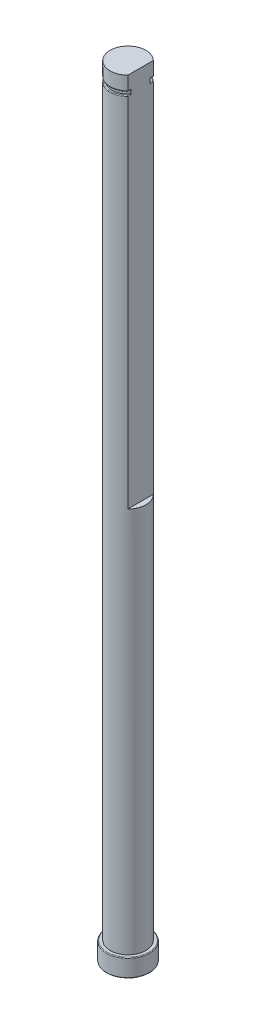
ISO-10303-21;
HEADER;
FILE_DESCRIPTION(('STEP AP214'),'2;1');
FILE_NAME('part.step','',(''),(''),'','','');
FILE_SCHEMA(('AUTOMOTIVE_DESIGN { 1 0 10303 214 1 1 1 1 }'));
ENDSEC;
DATA;
#1=APPLICATION_CONTEXT('core data for automotive mechanical design processes');
#2=APPLICATION_PROTOCOL_DEFINITION('international standard','automotive_design',2000,#1);
#3=PRODUCT_CONTEXT('',#1,'mechanical');
#4=PRODUCT('Part','Part','',(#3));
#5=PRODUCT_RELATED_PRODUCT_CATEGORY('part','',(#4));
#6=PRODUCT_DEFINITION_FORMATION('','',#4);
#7=PRODUCT_DEFINITION_CONTEXT('part definition',#1,'design');
#8=PRODUCT_DEFINITION('design','',#6,#7);
#9=PRODUCT_DEFINITION_SHAPE('','',#8);
#10=(LENGTH_UNIT() NAMED_UNIT(*) SI_UNIT(.MILLI.,.METRE.));
#11=(NAMED_UNIT(*) PLANE_ANGLE_UNIT() SI_UNIT($,.RADIAN.));
#12=(NAMED_UNIT(*) SI_UNIT($,.STERADIAN.) SOLID_ANGLE_UNIT());
#13=UNCERTAINTY_MEASURE_WITH_UNIT(LENGTH_MEASURE(1.E-05),#10,'distance_accuracy_value','');
#14=(GEOMETRIC_REPRESENTATION_CONTEXT(3) GLOBAL_UNCERTAINTY_ASSIGNED_CONTEXT((#13)) GLOBAL_UNIT_ASSIGNED_CONTEXT((#10,
#11,#12)) REPRESENTATION_CONTEXT('',''));
#15=CARTESIAN_POINT('',(0.,0.,0.));
#16=DIRECTION('',(0.,0.,1.));
#17=DIRECTION('',(1.,0.,0.));
#18=AXIS2_PLACEMENT_3D('',#15,#16,#17);
#19=CARTESIAN_POINT('',(0.,217.89,0.));
#20=DIRECTION('',(0.,-1.,0.));
#21=DIRECTION('',(0.,0.,-1.));
#22=AXIS2_PLACEMENT_3D('',#19,#20,#21);
#23=CYLINDRICAL_SURFACE('',#22,5.);
#24=DIRECTION('',(0.,1.,0.));
#25=VECTOR('',#24,1.);
#26=CARTESIAN_POINT('',(3.5,112.89,3.57071421427142));
#27=LINE('',#26,#25);
#28=CARTESIAN_POINT('',(3.5,112.89,3.57071421427142));
#29=VERTEX_POINT('',#28);
#30=CARTESIAN_POINT('',(3.5,212.69,3.57071421427142));
#31=VERTEX_POINT('',#30);
#32=EDGE_CURVE('E147',#29,#31,#27,.T.);
#33=ORIENTED_EDGE('',*,*,#32,.T.);
#34=CARTESIAN_POINT('',(0.,212.69,0.));
#35=DIRECTION('',(0.,1.,0.));
#36=DIRECTION('',(0.,0.,1.));
#37=AXIS2_PLACEMENT_3D('',#34,#35,#36);
#38=CIRCLE('',#37,5.);
#39=CARTESIAN_POINT('',(3.5,212.69,-3.57071421427142));
#40=VERTEX_POINT('',#39);
#41=EDGE_CURVE('E153',#31,#40,#38,.F.);
#42=ORIENTED_EDGE('',*,*,#41,.T.);
#43=DIRECTION('',(0.,1.,0.));
#44=VECTOR('',#43,1.);
#45=CARTESIAN_POINT('',(3.5,112.89,-3.57071421427142));
#46=LINE('',#45,#44);
#47=CARTESIAN_POINT('',(3.5,112.89,-3.57071421427142));
#48=VERTEX_POINT('',#47);
#49=EDGE_CURVE('E145',#48,#40,#46,.T.);
#50=ORIENTED_EDGE('',*,*,#49,.F.);
#51=CARTESIAN_POINT('',(0.,112.89,0.));
#52=DIRECTION('',(0.,1.,0.));
#53=DIRECTION('',(0.,0.,1.));
#54=AXIS2_PLACEMENT_3D('',#51,#52,#53);
#55=CIRCLE('',#54,5.);
#56=EDGE_CURVE('E130',#29,#48,#55,.T.);
#57=ORIENTED_EDGE('',*,*,#56,.F.);
#58=EDGE_LOOP('',(#33,#42,#50,#57));
#59=FACE_BOUND('',#58,.T.);
#60=CARTESIAN_POINT('',(0.,5.,0.));
#61=DIRECTION('',(0.,-1.,0.));
#62=DIRECTION('',(0.,0.,-1.));
#63=AXIS2_PLACEMENT_3D('',#60,#61,#62);
#64=CIRCLE('',#63,5.);
#65=CARTESIAN_POINT('',(0.,5.,-5.));
#66=VERTEX_POINT('',#65);
#67=EDGE_CURVE('E287',#66,#66,#64,.T.);
#68=ORIENTED_EDGE('',*,*,#67,.F.);
#69=EDGE_LOOP('',(#68));
#70=FACE_BOUND('',#69,.T.);
#71=ADVANCED_FACE('F51',(#59,#70),#23,.T.);
#72=CARTESIAN_POINT('',(3.5,214.09,-3.57071421427142));
#73=VERTEX_POINT('',#72);
#74=CARTESIAN_POINT('',(3.5,217.89,-3.57071421427142));
#75=VERTEX_POINT('',#74);
#76=EDGE_CURVE('E149',#73,#75,#46,.T.);
#77=ORIENTED_EDGE('',*,*,#76,.F.);
#78=CARTESIAN_POINT('',(0.,214.09,0.));
#79=DIRECTION('',(0.,1.,0.));
#80=DIRECTION('',(0.,0.,1.));
#81=AXIS2_PLACEMENT_3D('',#78,#79,#80);
#82=CIRCLE('',#81,5.);
#83=CARTESIAN_POINT('',(3.5,214.09,3.57071421427142));
#84=VERTEX_POINT('',#83);
#85=EDGE_CURVE('E195',#73,#84,#82,.T.);
#86=ORIENTED_EDGE('',*,*,#85,.T.);
#87=CARTESIAN_POINT('',(3.5,217.89,3.57071421427142));
#88=VERTEX_POINT('',#87);
#89=EDGE_CURVE('E155',#84,#88,#27,.T.);
#90=ORIENTED_EDGE('',*,*,#89,.T.);
#91=CARTESIAN_POINT('',(0.,217.89,0.));
#92=DIRECTION('',(0.,1.,0.));
#93=DIRECTION('',(0.,0.,1.));
#94=AXIS2_PLACEMENT_3D('',#91,#92,#93);
#95=CIRCLE('',#94,5.);
#96=EDGE_CURVE('E162',#75,#88,#95,.T.);
#97=ORIENTED_EDGE('',*,*,#96,.F.);
#98=EDGE_LOOP('',(#77,#86,#90,#97));
#99=FACE_BOUND('',#98,.T.);
#100=ADVANCED_FACE('F228',(#99),#23,.T.);
#101=CARTESIAN_POINT('',(0.,217.89,0.));
#102=DIRECTION('',(0.,1.,0.));
#103=DIRECTION('',(0.,0.,1.));
#104=AXIS2_PLACEMENT_3D('',#101,#102,#103);
#105=PLANE('',#104);
#106=DIRECTION('',(0.,0.,1.));
#107=VECTOR('',#106,1.);
#108=CARTESIAN_POINT('',(3.5,217.89,0.));
#109=LINE('',#108,#107);
#110=EDGE_CURVE('E138',#75,#88,#109,.T.);
#111=ORIENTED_EDGE('',*,*,#110,.F.);
#112=ORIENTED_EDGE('',*,*,#96,.T.);
#113=EDGE_LOOP('',(#111,#112));
#114=FACE_BOUND('',#113,.T.);
#115=ADVANCED_FACE('F330',(#114),#105,.T.);
#116=CARTESIAN_POINT('',(3.5,112.89,0.));
#117=DIRECTION('',(-1.,0.,0.));
#118=DIRECTION('',(0.,0.,1.));
#119=AXIS2_PLACEMENT_3D('',#116,#117,#118);
#120=PLANE('',#119);
#121=ORIENTED_EDGE('',*,*,#89,.F.);
#122=DIRECTION('',(0.,0.,-1.));
#123=VECTOR('',#122,1.);
#124=CARTESIAN_POINT('',(3.5,214.09,0.));
#125=LINE('',#124,#123);
#126=CARTESIAN_POINT('',(3.5,214.09,2.66645832519468));
#127=VERTEX_POINT('',#126);
#128=EDGE_CURVE('E175',#84,#127,#125,.T.);
#129=ORIENTED_EDGE('',*,*,#128,.T.);
#130=DIRECTION('',(0.,-1.,0.));
#131=VECTOR('',#130,1.);
#132=CARTESIAN_POINT('',(3.5,213.89,2.66645832519468));
#133=LINE('',#132,#131);
#134=CARTESIAN_POINT('',(3.5,212.69,2.66645832519468));
#135=VERTEX_POINT('',#134);
#136=EDGE_CURVE('E291',#127,#135,#133,.T.);
#137=ORIENTED_EDGE('',*,*,#136,.T.);
#138=DIRECTION('',(0.,0.,-1.));
#139=VECTOR('',#138,1.);
#140=CARTESIAN_POINT('',(3.5,212.69,3.57071421427142));
#141=LINE('',#140,#139);
#142=EDGE_CURVE('E172',#135,#31,#141,.F.);
#143=ORIENTED_EDGE('',*,*,#142,.T.);
#144=ORIENTED_EDGE('',*,*,#32,.F.);
#145=DIRECTION('',(0.,0.,1.));
#146=VECTOR('',#145,1.);
#147=CARTESIAN_POINT('',(3.5,112.89,0.));
#148=LINE('',#147,#146);
#149=EDGE_CURVE('E133',#48,#29,#148,.T.);
#150=ORIENTED_EDGE('',*,*,#149,.F.);
#151=ORIENTED_EDGE('',*,*,#49,.T.);
#152=DIRECTION('',(0.,0.,-1.));
#153=VECTOR('',#152,1.);
#154=CARTESIAN_POINT('',(3.5,212.69,-2.66645832519468));
#155=LINE('',#154,#153);
#156=CARTESIAN_POINT('',(3.5,212.69,-2.66645832519468));
#157=VERTEX_POINT('',#156);
#158=EDGE_CURVE('E166',#40,#157,#155,.F.);
#159=ORIENTED_EDGE('',*,*,#158,.T.);
#160=DIRECTION('',(0.,-1.,0.));
#161=VECTOR('',#160,1.);
#162=CARTESIAN_POINT('',(3.5,213.89,-2.66645832519468));
#163=LINE('',#162,#161);
#164=CARTESIAN_POINT('',(3.5,214.09,-2.66645832519468));
#165=VERTEX_POINT('',#164);
#166=EDGE_CURVE('E350',#165,#157,#163,.T.);
#167=ORIENTED_EDGE('',*,*,#166,.F.);
#168=DIRECTION('',(0.,0.,-1.));
#169=VECTOR('',#168,1.);
#170=CARTESIAN_POINT('',(3.5,214.09,0.));
#171=LINE('',#170,#169);
#172=EDGE_CURVE('E169',#165,#73,#171,.T.);
#173=ORIENTED_EDGE('',*,*,#172,.T.);
#174=ORIENTED_EDGE('',*,*,#76,.T.);
#175=ORIENTED_EDGE('',*,*,#110,.T.);
#176=EDGE_LOOP('',(#121,#129,#137,#143,#144,#150,#151,#159,#167,#173,#174,#175));
#177=FACE_BOUND('',#176,.T.);
#178=ADVANCED_FACE('F143',(#177),#120,.F.);
#179=CARTESIAN_POINT('',(0.,112.89,0.));
#180=DIRECTION('',(0.,1.,0.));
#181=DIRECTION('',(0.,0.,1.));
#182=AXIS2_PLACEMENT_3D('',#179,#180,#181);
#183=PLANE('',#182);
#184=ORIENTED_EDGE('',*,*,#56,.T.);
#185=ORIENTED_EDGE('',*,*,#149,.T.);
#186=EDGE_LOOP('',(#184,#185));
#187=FACE_BOUND('',#186,.T.);
#188=ADVANCED_FACE('F132',(#187),#183,.T.);
#189=CARTESIAN_POINT('',(0.,213.89,0.));
#190=DIRECTION('',(0.,-1.,0.));
#191=DIRECTION('',(0.,0.,-1.));
#192=AXIS2_PLACEMENT_3D('',#189,#190,#191);
#193=CYLINDRICAL_SURFACE('',#192,4.4);
#194=ORIENTED_EDGE('',*,*,#166,.T.);
#195=CARTESIAN_POINT('',(3.5,212.69,-2.66645832519468));
#196=CARTESIAN_POINT('',(3.50001572959241,212.698340122319,-2.66643640554394));
#197=CARTESIAN_POINT('',(3.4994794322201,212.706645047938,-2.66714170397318));
#198=CARTESIAN_POINT('',(3.49744914980149,212.72282973883,-2.66980408832565));
#199=CARTESIAN_POINT('',(3.49596704452966,212.730713481461,-2.67174564561712));
#200=CARTESIAN_POINT('',(3.49219437276219,212.745882112243,-2.67667468311572));
#201=CARTESIAN_POINT('',(3.48990775386464,212.753169714122,-2.67965705566883));
#202=CARTESIAN_POINT('',(3.48468414896616,212.767118941027,-2.68644653944985));
#203=CARTESIAN_POINT('',(3.48174501247574,212.773778389985,-2.69025637681479));
#204=CARTESIAN_POINT('',(3.47355573391022,212.790008437893,-2.70082882140917));
#205=CARTESIAN_POINT('',(3.46793819926475,212.799097609842,-2.70804344153627));
#206=CARTESIAN_POINT('',(3.45585807060967,212.815755486826,-2.72344302343464));
#207=CARTESIAN_POINT('',(3.44939357226424,212.82332066498,-2.73163016786257));
#208=CARTESIAN_POINT('',(3.43211600590083,212.840899805874,-2.75333661388644));
#209=CARTESIAN_POINT('',(3.42087785925408,212.849948582211,-2.76729720347349));
#210=CARTESIAN_POINT('',(3.39747563270113,212.865195792089,-2.79598021842651));
#211=CARTESIAN_POINT('',(3.38530944990888,212.871387513773,-2.81070434824146));
#212=CARTESIAN_POINT('',(3.36107279881261,212.880866149937,-2.83963440052699));
#213=CARTESIAN_POINT('',(3.34903654530551,212.884298764035,-2.85382189393174));
#214=CARTESIAN_POINT('',(3.32469473999505,212.888847187677,-2.88214451604545));
#215=CARTESIAN_POINT('',(3.31239200195113,212.889980765003,-2.89627919705818));
#216=CARTESIAN_POINT('',(3.3,212.89,-2.91032644217105));
#217=B_SPLINE_CURVE_WITH_KNOTS('',3,(#195,#196,#197,#198,#199,#200,#201,#202,#203,#204,#205,
#206,#207,#208,#209,#210,#211,#212,#213,#214,#215,#216),.UNSPECIFIED.,.F.,.F.,(4,2,2,2,2,2,2,2,
2,2,4),(0.,0.0249177085251996,0.0495284395601784,0.0740200568533302,0.0985936216132089,
0.137053189663787,0.175600764822116,0.235503299305924,0.295545850562678,0.352159352585193,
0.4083336318508),.UNSPECIFIED.);
#218=CARTESIAN_POINT('',(3.3,212.89,-2.91032644217105));
#219=VERTEX_POINT('',#218);
#220=EDGE_CURVE('E245',#157,#219,#217,.T.);
#221=ORIENTED_EDGE('',*,*,#220,.T.);
#222=CARTESIAN_POINT('',(0.,212.89,0.));
#223=DIRECTION('',(0.,1.,0.));
#224=DIRECTION('',(0.,0.,1.));
#225=AXIS2_PLACEMENT_3D('',#222,#223,#224);
#226=CIRCLE('',#225,4.4);
#227=CARTESIAN_POINT('',(3.3,212.89,2.91032644217105));
#228=VERTEX_POINT('',#227);
#229=EDGE_CURVE('E258',#219,#228,#226,.T.);
#230=ORIENTED_EDGE('',*,*,#229,.T.);
#231=CARTESIAN_POINT('',(3.3,212.89,2.91032644217105));
#232=CARTESIAN_POINT('',(3.30847190666142,212.889995855485,2.90072037980732));
#233=CARTESIAN_POINT('',(3.31689429232194,212.889462097017,2.89108536199942));
#234=CARTESIAN_POINT('',(3.33360904440519,212.887336862343,2.87179632769245));
#235=CARTESIAN_POINT('',(3.34190122018778,212.88574396082,2.86214230309417));
#236=CARTESIAN_POINT('',(3.36665779349885,212.879340592568,2.83306597750165));
#237=CARTESIAN_POINT('',(3.38283903785468,212.87290543495,2.81371459139366));
#238=CARTESIAN_POINT('',(3.40813355912034,212.858623074177,2.78296011017199));
#239=CARTESIAN_POINT('',(3.41766366547705,212.852157872184,2.7712433915368));
#240=CARTESIAN_POINT('',(3.43593526326525,212.837176225576,2.74855567544081));
#241=CARTESIAN_POINT('',(3.44467929474056,212.828666740022,2.7375823065774));
#242=CARTESIAN_POINT('',(3.45840670987927,212.812399023565,2.72020300256407));
#243=CARTESIAN_POINT('',(3.46369981678296,212.805267390093,2.71345688038356));
#244=CARTESIAN_POINT('',(3.47355436797751,212.789813095747,2.70083018049559));
#245=CARTESIAN_POINT('',(3.47811663408155,212.781491792847,2.69494863121841));
#246=CARTESIAN_POINT('',(3.48516068862098,212.765948160981,2.68582934950565));
#247=CARTESIAN_POINT('',(3.48787495829382,212.759002991741,2.68230186537504));
#248=CARTESIAN_POINT('',(3.49258107999117,212.744500873333,2.67617119159258));
#249=CARTESIAN_POINT('',(3.4945752152582,212.736945952328,2.67356508121489));
#250=CARTESIAN_POINT('',(3.49738424333157,212.722867949587,2.66988914128381));
#251=CARTESIAN_POINT('',(3.49835268101703,212.71642820271,2.66861958587352));
#252=CARTESIAN_POINT('',(3.49966642602793,212.703331125213,2.66689618824022));
#253=CARTESIAN_POINT('',(3.50000706482059,212.696672536283,2.6664484574925));
#254=CARTESIAN_POINT('',(3.5,212.69,2.66645832519468));
#255=B_SPLINE_CURVE_WITH_KNOTS('',3,(#231,#232,#233,#234,#235,#236,#237,#238,#239,#240,#241,
#242,#243,#244,#245,#246,#247,#248,#249,#250,#251,#252,#253,#254),.UNSPECIFIED.,.F.,.F.,(4,2,2,
2,2,2,2,2,2,2,2,4),(0.,0.0383917197041378,0.0768352090068305,0.154454266571866,
0.203624652584167,0.252629969364985,0.285999301981326,0.319330844108164,0.343992336356021,
0.368574936307703,0.388399211678372,0.408370321543627),.UNSPECIFIED.);
#256=EDGE_CURVE('E209',#228,#135,#255,.T.);
#257=ORIENTED_EDGE('',*,*,#256,.T.);
#258=ORIENTED_EDGE('',*,*,#136,.F.);
#259=CARTESIAN_POINT('',(3.5,214.09,2.66645832519468));
#260=CARTESIAN_POINT('',(3.50001572959241,214.081659877681,2.66643640554394));
#261=CARTESIAN_POINT('',(3.4994794322201,214.073354952062,2.66714170397318));
#262=CARTESIAN_POINT('',(3.49744914980149,214.05717026117,2.66980408832565));
#263=CARTESIAN_POINT('',(3.49596704452966,214.049286518539,2.67174564561711));
#264=CARTESIAN_POINT('',(3.49219437276219,214.034117887757,2.67667468311572));
#265=CARTESIAN_POINT('',(3.48990775386463,214.026830285878,2.67965705566884));
#266=CARTESIAN_POINT('',(3.48468414896616,214.012881058973,2.68644653944986));
#267=CARTESIAN_POINT('',(3.48174501247574,214.006221610015,2.6902563768148));
#268=CARTESIAN_POINT('',(3.47355573391022,213.989991562107,2.70082882140917));
#269=CARTESIAN_POINT('',(3.46793819926475,213.980902390158,2.70804344153627));
#270=CARTESIAN_POINT('',(3.45585807060967,213.964244513174,2.72344302343464));
#271=CARTESIAN_POINT('',(3.44939357226424,213.95667933502,2.73163016786257));
#272=CARTESIAN_POINT('',(3.43211600590083,213.939100194126,2.75333661388644));
#273=CARTESIAN_POINT('',(3.42087785925408,213.930051417789,2.76729720347349));
#274=CARTESIAN_POINT('',(3.39747563270113,213.914804207911,2.79598021842651));
#275=CARTESIAN_POINT('',(3.38530944990888,213.908612486227,2.81070434824146));
#276=CARTESIAN_POINT('',(3.36107279881261,213.899133850063,2.83963440052699));
#277=CARTESIAN_POINT('',(3.34903654530551,213.895701235965,2.85382189393174));
#278=CARTESIAN_POINT('',(3.32469473999505,213.891152812323,2.88214451604545));
#279=CARTESIAN_POINT('',(3.31239200195113,213.890019234997,2.89627919705818));
#280=CARTESIAN_POINT('',(3.3,213.89,2.91032644217105));
#281=B_SPLINE_CURVE_WITH_KNOTS('',3,(#259,#260,#261,#262,#263,#264,#265,#266,#267,#268,#269,
#270,#271,#272,#273,#274,#275,#276,#277,#278,#279,#280),.UNSPECIFIED.,.F.,.F.,(4,2,2,2,2,2,2,2,
2,2,4),(0.,0.0249177085251715,0.0495284395601784,0.0740200568533605,0.0985936216132095,
0.137053189663788,0.175600764822117,0.235503299305924,0.295545850562679,0.352159352585194,
0.408333631850801),.UNSPECIFIED.);
#282=CARTESIAN_POINT('',(3.3,213.89,2.91032644217105));
#283=VERTEX_POINT('',#282);
#284=EDGE_CURVE('E200',#127,#283,#281,.T.);
#285=ORIENTED_EDGE('',*,*,#284,.T.);
#286=CARTESIAN_POINT('',(0.,213.89,0.));
#287=DIRECTION('',(0.,1.,0.));
#288=DIRECTION('',(0.,0.,1.));
#289=AXIS2_PLACEMENT_3D('',#286,#287,#288);
#290=CIRCLE('',#289,4.4);
#291=CARTESIAN_POINT('',(3.3,213.89,-2.91032644217105));
#292=VERTEX_POINT('',#291);
#293=EDGE_CURVE('E356',#292,#283,#290,.T.);
#294=ORIENTED_EDGE('',*,*,#293,.F.);
#295=CARTESIAN_POINT('',(3.3,213.89,-2.91032644217105));
#296=CARTESIAN_POINT('',(3.30847190666142,213.890004144515,-2.90072037980732));
#297=CARTESIAN_POINT('',(3.31689429232194,213.890537902983,-2.89108536199942));
#298=CARTESIAN_POINT('',(3.33360904440519,213.892663137657,-2.87179632769245));
#299=CARTESIAN_POINT('',(3.34190122018778,213.89425603918,-2.86214230309417));
#300=CARTESIAN_POINT('',(3.36665779349885,213.900659407432,-2.83306597750165));
#301=CARTESIAN_POINT('',(3.38283903785468,213.90709456505,-2.81371459139366));
#302=CARTESIAN_POINT('',(3.40813355912034,213.921376925823,-2.78296011017199));
#303=CARTESIAN_POINT('',(3.41766366547704,213.927842127816,-2.7712433915368));
#304=CARTESIAN_POINT('',(3.43593526326524,213.942823774424,-2.74855567544082));
#305=CARTESIAN_POINT('',(3.44467929474056,213.951333259978,-2.73758230657741));
#306=CARTESIAN_POINT('',(3.45840670987928,213.967600976435,-2.72020300256406));
#307=CARTESIAN_POINT('',(3.46369981678298,213.974732609907,-2.71345688038354));
#308=CARTESIAN_POINT('',(3.47355436797753,213.990186904253,-2.70083018049556));
#309=CARTESIAN_POINT('',(3.47811663408155,213.998508207153,-2.6949486312184));
#310=CARTESIAN_POINT('',(3.48516068862098,214.014051839019,-2.68582934950566));
#311=CARTESIAN_POINT('',(3.48787495829382,214.020997008259,-2.68230186537504));
#312=CARTESIAN_POINT('',(3.49258107999117,214.035499126667,-2.67617119159258));
#313=CARTESIAN_POINT('',(3.4945752152582,214.043054047672,-2.67356508121489));
#314=CARTESIAN_POINT('',(3.49738424333156,214.057132050413,-2.66988914128381));
#315=CARTESIAN_POINT('',(3.49835268101703,214.06357179729,-2.66861958587352));
#316=CARTESIAN_POINT('',(3.49966642602793,214.076668874787,-2.66689618824022));
#317=CARTESIAN_POINT('',(3.50000706482059,214.083327463717,-2.6664484574925));
#318=CARTESIAN_POINT('',(3.5,214.09,-2.66645832519468));
#319=B_SPLINE_CURVE_WITH_KNOTS('',3,(#295,#296,#297,#298,#299,#300,#301,#302,#303,#304,#305,
#306,#307,#308,#309,#310,#311,#312,#313,#314,#315,#316,#317,#318),.UNSPECIFIED.,.F.,.F.,(4,2,2,
2,2,2,2,2,2,2,2,4),(0.,0.038391719704135,0.0768352090068305,0.154454266571866,0.203624652584159,
0.252629969364985,0.285999301981374,0.319330844108164,0.343992336355992,0.368574936307704,
0.388399211678373,0.408370321543628),.UNSPECIFIED.);
#320=EDGE_CURVE('E274',#292,#165,#319,.T.);
#321=ORIENTED_EDGE('',*,*,#320,.T.);
#322=EDGE_LOOP('',(#194,#221,#230,#257,#258,#285,#294,#321));
#323=FACE_BOUND('',#322,.T.);
#324=ADVANCED_FACE('F216',(#323),#193,.T.);
#325=CARTESIAN_POINT('',(0.,213.89,0.));
#326=DIRECTION('',(0.,1.,0.));
#327=DIRECTION('',(0.,0.,1.));
#328=AXIS2_PLACEMENT_3D('',#325,#326,#327);
#329=PLANE('',#328);
#330=ORIENTED_EDGE('',*,*,#293,.T.);
#331=DIRECTION('',(0.,0.,-1.));
#332=VECTOR('',#331,1.);
#333=CARTESIAN_POINT('',(3.3,213.89,0.));
#334=LINE('',#333,#332);
#335=CARTESIAN_POINT('',(3.3,213.89,3.48568501158667));
#336=VERTEX_POINT('',#335);
#337=EDGE_CURVE('E185',#283,#336,#334,.F.);
#338=ORIENTED_EDGE('',*,*,#337,.T.);
#339=CARTESIAN_POINT('',(0.,213.89,0.));
#340=DIRECTION('',(0.,1.,0.));
#341=DIRECTION('',(0.,0.,1.));
#342=AXIS2_PLACEMENT_3D('',#339,#340,#341);
#343=CIRCLE('',#342,4.8);
#344=CARTESIAN_POINT('',(3.3,213.89,-3.48568501158668));
#345=VERTEX_POINT('',#344);
#346=EDGE_CURVE('E179',#336,#345,#343,.F.);
#347=ORIENTED_EDGE('',*,*,#346,.T.);
#348=DIRECTION('',(0.,0.,-1.));
#349=VECTOR('',#348,1.);
#350=CARTESIAN_POINT('',(3.3,213.89,0.));
#351=LINE('',#350,#349);
#352=EDGE_CURVE('E182',#345,#292,#351,.F.);
#353=ORIENTED_EDGE('',*,*,#352,.T.);
#354=EDGE_LOOP('',(#330,#338,#347,#353));
#355=FACE_BOUND('',#354,.T.);
#356=ADVANCED_FACE('F362',(#355),#329,.F.);
#357=CARTESIAN_POINT('',(0.,212.89,0.));
#358=DIRECTION('',(0.,1.,0.));
#359=DIRECTION('',(0.,0.,1.));
#360=AXIS2_PLACEMENT_3D('',#357,#358,#359);
#361=PLANE('',#360);
#362=CARTESIAN_POINT('',(0.,212.89,0.));
#363=DIRECTION('',(0.,1.,0.));
#364=DIRECTION('',(0.,0.,1.));
#365=AXIS2_PLACEMENT_3D('',#362,#363,#364);
#366=CIRCLE('',#365,4.8);
#367=CARTESIAN_POINT('',(3.3,212.89,-3.48568501158668));
#368=VERTEX_POINT('',#367);
#369=CARTESIAN_POINT('',(3.3,212.89,3.48568501158667));
#370=VERTEX_POINT('',#369);
#371=EDGE_CURVE('E67',#368,#370,#366,.T.);
#372=ORIENTED_EDGE('',*,*,#371,.T.);
#373=DIRECTION('',(0.,0.,-1.));
#374=VECTOR('',#373,1.);
#375=CARTESIAN_POINT('',(3.3,212.89,2.66645832519468));
#376=LINE('',#375,#374);
#377=EDGE_CURVE('E192',#370,#228,#376,.T.);
#378=ORIENTED_EDGE('',*,*,#377,.T.);
#379=ORIENTED_EDGE('',*,*,#229,.F.);
#380=DIRECTION('',(0.,0.,-1.));
#381=VECTOR('',#380,1.);
#382=CARTESIAN_POINT('',(3.3,212.89,-3.57071421427142));
#383=LINE('',#382,#381);
#384=EDGE_CURVE('E72',#219,#368,#383,.T.);
#385=ORIENTED_EDGE('',*,*,#384,.T.);
#386=EDGE_LOOP('',(#372,#378,#379,#385));
#387=FACE_BOUND('',#386,.T.);
#388=ADVANCED_FACE('F269',(#387),#361,.T.);
#389=CARTESIAN_POINT('',(3.3,214.09,0.));
#390=DIRECTION('',(0.,0.,-1.));
#391=DIRECTION('',(-1.,0.,0.));
#392=AXIS2_PLACEMENT_3D('',#389,#390,#391);
#393=CYLINDRICAL_SURFACE('',#392,0.2);
#394=ORIENTED_EDGE('',*,*,#320,.F.);
#395=ORIENTED_EDGE('',*,*,#352,.F.);
#396=CARTESIAN_POINT('',(3.5,214.09,-3.57071421427142));
#397=CARTESIAN_POINT('',(3.50001202853429,214.079382809665,-3.57071906284533));
#398=CARTESIAN_POINT('',(3.49915539882841,214.068773469745,-3.5703594095157));
#399=CARTESIAN_POINT('',(3.49579916765285,214.047894872728,-3.56894919847386));
#400=CARTESIAN_POINT('',(3.49330422944727,214.037624737012,-3.56790060175822));
#401=CARTESIAN_POINT('',(3.48676567383597,214.017688181021,-3.56515059809789));
#402=CARTESIAN_POINT('',(3.48272248587823,214.0080215942,-3.56344937217692));
#403=CARTESIAN_POINT('',(3.47324393907842,213.989528674918,-3.55945723610596));
#404=CARTESIAN_POINT('',(3.46780805280431,213.980702662535,-3.55716610254903));
#405=CARTESIAN_POINT('',(3.45553926758007,213.963826283551,-3.55198883506433));
#406=CARTESIAN_POINT('',(3.44866772485283,213.955809147366,-3.5490862184826));
#407=CARTESIAN_POINT('',(3.43386176614914,213.941035265076,-3.54282304109023));
#408=CARTESIAN_POINT('',(3.42592699164064,213.934278945977,-3.53946232579764));
#409=CARTESIAN_POINT('',(3.40859947071133,213.921687223387,-3.53211167438113));
#410=CARTESIAN_POINT('',(3.39914226821589,213.915957080457,-3.52809357129958));
#411=CARTESIAN_POINT('',(3.37952729270225,213.906164185875,-3.51974420815357));
#412=CARTESIAN_POINT('',(3.36936931032981,213.902101935038,-3.51541285448834));
#413=CARTESIAN_POINT('',(3.34988928019782,213.896087736977,-3.50709039062174));
#414=CARTESIAN_POINT('',(3.34061718964717,213.893938286675,-3.50312256568254));
#415=CARTESIAN_POINT('',(3.32191154981102,213.89097924408,-3.49510381226007));
#416=CARTESIAN_POINT('',(3.31247833632011,213.890167143974,-3.49105305377615));
#417=CARTESIAN_POINT('',(3.30203250822153,213.890007729618,-3.48655958215352));
#418=CARTESIAN_POINT('',(3.30101617405265,213.889999981842,-3.48612230398671));
#419=CARTESIAN_POINT('',(3.3,213.89,-3.48568501158668));
#420=B_SPLINE_CURVE_WITH_KNOTS('',3,(#396,#397,#398,#399,#400,#401,#402,#403,#404,#405,#406,
#407,#408,#409,#410,#411,#412,#413,#414,#415,#416,#417,#418,#419),.UNSPECIFIED.,.F.,.F.,(4,2,2,
2,2,2,2,2,2,2,2,4),(0.,0.0317988173652862,0.0635075129832495,0.0952074197200754,
0.126919349394092,0.159631156340519,0.192354021915411,0.227500341683065,0.262657207078277,
0.293508931495438,0.324302736257748,0.327621926842854),.UNSPECIFIED.);
#421=EDGE_CURVE('E243',#73,#345,#420,.T.);
#422=ORIENTED_EDGE('',*,*,#421,.F.);
#423=ORIENTED_EDGE('',*,*,#172,.F.);
#424=EDGE_LOOP('',(#394,#395,#422,#423));
#425=FACE_BOUND('',#424,.T.);
#426=ADVANCED_FACE('F266',(#425),#393,.T.);
#427=CARTESIAN_POINT('',(0.,214.09,0.));
#428=DIRECTION('',(0.,1.,0.));
#429=DIRECTION('',(0.,0.,1.));
#430=AXIS2_PLACEMENT_3D('',#427,#428,#429);
#431=TOROIDAL_SURFACE('',#430,4.8,0.2);
#432=ORIENTED_EDGE('',*,*,#421,.T.);
#433=ORIENTED_EDGE('',*,*,#346,.F.);
#434=CARTESIAN_POINT('',(3.5,214.09,3.57071421427142));
#435=CARTESIAN_POINT('',(3.50001202853429,214.079382809665,3.57071906284533));
#436=CARTESIAN_POINT('',(3.49915539882841,214.068773469745,3.5703594095157));
#437=CARTESIAN_POINT('',(3.49579916765285,214.047894872728,3.56894919847386));
#438=CARTESIAN_POINT('',(3.49330422944727,214.037624737012,3.56790060175822));
#439=CARTESIAN_POINT('',(3.48676567383597,214.017688181021,3.56515059809789));
#440=CARTESIAN_POINT('',(3.48272248587823,214.0080215942,3.56344937217692));
#441=CARTESIAN_POINT('',(3.47324393907842,213.989528674918,3.55945723610596));
#442=CARTESIAN_POINT('',(3.46780805280431,213.980702662535,3.55716610254903));
#443=CARTESIAN_POINT('',(3.45553926758007,213.963826283551,3.55198883506433));
#444=CARTESIAN_POINT('',(3.44866772485283,213.955809147366,3.5490862184826));
#445=CARTESIAN_POINT('',(3.43386176614914,213.941035265076,3.54282304109023));
#446=CARTESIAN_POINT('',(3.42592699164064,213.934278945977,3.53946232579764));
#447=CARTESIAN_POINT('',(3.40859947071133,213.921687223387,3.53211167438113));
#448=CARTESIAN_POINT('',(3.39914226821589,213.915957080457,3.52809357129958));
#449=CARTESIAN_POINT('',(3.37952729270225,213.906164185875,3.51974420815357));
#450=CARTESIAN_POINT('',(3.36936931032981,213.902101935038,3.51541285448834));
#451=CARTESIAN_POINT('',(3.34988928019782,213.896087736977,3.50709039062174));
#452=CARTESIAN_POINT('',(3.34061718964717,213.893938286675,3.50312256568254));
#453=CARTESIAN_POINT('',(3.32191154981102,213.89097924408,3.49510381226007));
#454=CARTESIAN_POINT('',(3.31247833632011,213.890167143974,3.49105305377615));
#455=CARTESIAN_POINT('',(3.30203250822153,213.890007729618,3.48655958215352));
#456=CARTESIAN_POINT('',(3.30101617405265,213.889999981842,3.48612230398671));
#457=CARTESIAN_POINT('',(3.3,213.89,3.48568501158668));
#458=B_SPLINE_CURVE_WITH_KNOTS('',3,(#434,#435,#436,#437,#438,#439,#440,#441,#442,#443,#444,
#445,#446,#447,#448,#449,#450,#451,#452,#453,#454,#455,#456,#457),.UNSPECIFIED.,.F.,.F.,(4,2,2,
2,2,2,2,2,2,2,2,4),(0.,0.0317988173652862,0.0635075129832495,0.0952074197200754,
0.126919349394092,0.159631156340519,0.192354021915411,0.227500341683065,0.262657207078277,
0.293508931495438,0.324302736257748,0.327621926842854),.UNSPECIFIED.);
#459=EDGE_CURVE('E234',#84,#336,#458,.T.);
#460=ORIENTED_EDGE('',*,*,#459,.F.);
#461=ORIENTED_EDGE('',*,*,#85,.F.);
#462=EDGE_LOOP('',(#432,#433,#460,#461));
#463=FACE_BOUND('',#462,.T.);
#464=ADVANCED_FACE('F226',(#463),#431,.T.);
#465=CARTESIAN_POINT('',(3.3,214.09,0.));
#466=DIRECTION('',(0.,0.,-1.));
#467=DIRECTION('',(-1.,0.,0.));
#468=AXIS2_PLACEMENT_3D('',#465,#466,#467);
#469=CYLINDRICAL_SURFACE('',#468,0.2);
#470=ORIENTED_EDGE('',*,*,#459,.T.);
#471=ORIENTED_EDGE('',*,*,#337,.F.);
#472=ORIENTED_EDGE('',*,*,#284,.F.);
#473=ORIENTED_EDGE('',*,*,#128,.F.);
#474=EDGE_LOOP('',(#470,#471,#472,#473));
#475=FACE_BOUND('',#474,.T.);
#476=ADVANCED_FACE('F220',(#475),#469,.T.);
#477=CARTESIAN_POINT('',(3.3,212.69,0.));
#478=DIRECTION('',(0.,0.,1.));
#479=DIRECTION('',(1.,0.,0.));
#480=AXIS2_PLACEMENT_3D('',#477,#478,#479);
#481=CYLINDRICAL_SURFACE('',#480,0.2);
#482=ORIENTED_EDGE('',*,*,#220,.F.);
#483=ORIENTED_EDGE('',*,*,#158,.F.);
#484=CARTESIAN_POINT('',(3.5,212.69,-3.57071421427142));
#485=CARTESIAN_POINT('',(3.50001202853429,212.700617190335,-3.57071906284533));
#486=CARTESIAN_POINT('',(3.4991553988284,212.711226530255,-3.57035940951569));
#487=CARTESIAN_POINT('',(3.49579916765285,212.732105127272,-3.56894919847386));
#488=CARTESIAN_POINT('',(3.49330422944727,212.742375262988,-3.56790060175822));
#489=CARTESIAN_POINT('',(3.48676567383597,212.762311818979,-3.56515059809789));
#490=CARTESIAN_POINT('',(3.48272248587823,212.7719784058,-3.56344937217692));
#491=CARTESIAN_POINT('',(3.47324393907842,212.790471325082,-3.55945723610596));
#492=CARTESIAN_POINT('',(3.46780805280431,212.799297337465,-3.55716610254903));
#493=CARTESIAN_POINT('',(3.45553926758007,212.816173716449,-3.55198883506433));
#494=CARTESIAN_POINT('',(3.44866772485282,212.824190852634,-3.54908621848259));
#495=CARTESIAN_POINT('',(3.43386176614913,212.838964734924,-3.54282304109022));
#496=CARTESIAN_POINT('',(3.42592699164064,212.845721054023,-3.53946232579764));
#497=CARTESIAN_POINT('',(3.40859947071133,212.858312776613,-3.53211167438113));
#498=CARTESIAN_POINT('',(3.39914226821589,212.864042919543,-3.52809357129958));
#499=CARTESIAN_POINT('',(3.37952729270225,212.873835814125,-3.51974420815357));
#500=CARTESIAN_POINT('',(3.36936931032981,212.877898064962,-3.51541285448834));
#501=CARTESIAN_POINT('',(3.34988928019782,212.883912263023,-3.50709039062174));
#502=CARTESIAN_POINT('',(3.34061718964717,212.886061713325,-3.50312256568254));
#503=CARTESIAN_POINT('',(3.32191154981102,212.88902075592,-3.49510381226007));
#504=CARTESIAN_POINT('',(3.31247833632011,212.889832856026,-3.49105305377615));
#505=CARTESIAN_POINT('',(3.30203250822153,212.889992270382,-3.48655958215352));
#506=CARTESIAN_POINT('',(3.30101617405265,212.890000018158,-3.48612230398671));
#507=CARTESIAN_POINT('',(3.3,212.89,-3.48568501158668));
#508=B_SPLINE_CURVE_WITH_KNOTS('',3,(#484,#485,#486,#487,#488,#489,#490,#491,#492,#493,#494,
#495,#496,#497,#498,#499,#500,#501,#502,#503,#504,#505,#506,#507),.UNSPECIFIED.,.F.,.F.,(4,2,2,
2,2,2,2,2,2,2,2,4),(0.,0.0317988173653143,0.0635075129832495,0.0952074197200754,
0.126919349394092,0.159631156340529,0.192354021915409,0.227500341683063,0.262657207078275,
0.293508931495432,0.324302736257747,0.327621926842852),.UNSPECIFIED.);
#509=EDGE_CURVE('E244',#368,#40,#508,.F.);
#510=ORIENTED_EDGE('',*,*,#509,.F.);
#511=ORIENTED_EDGE('',*,*,#384,.F.);
#512=EDGE_LOOP('',(#482,#483,#510,#511));
#513=FACE_BOUND('',#512,.T.);
#514=ADVANCED_FACE('F225',(#513),#481,.T.);
#515=CARTESIAN_POINT('',(0.,212.69,0.));
#516=DIRECTION('',(0.,1.,0.));
#517=DIRECTION('',(0.,0.,1.));
#518=AXIS2_PLACEMENT_3D('',#515,#516,#517);
#519=TOROIDAL_SURFACE('',#518,4.8,0.2);
#520=ORIENTED_EDGE('',*,*,#509,.T.);
#521=ORIENTED_EDGE('',*,*,#41,.F.);
#522=CARTESIAN_POINT('',(3.5,212.69,3.57071421427142));
#523=CARTESIAN_POINT('',(3.50001202853429,212.700617190335,3.57071906284533));
#524=CARTESIAN_POINT('',(3.4991553988284,212.711226530255,3.57035940951569));
#525=CARTESIAN_POINT('',(3.49579916765285,212.732105127272,3.56894919847386));
#526=CARTESIAN_POINT('',(3.49330422944727,212.742375262988,3.56790060175822));
#527=CARTESIAN_POINT('',(3.48676567383597,212.762311818979,3.56515059809789));
#528=CARTESIAN_POINT('',(3.48272248587823,212.7719784058,3.56344937217692));
#529=CARTESIAN_POINT('',(3.47324393907842,212.790471325082,3.55945723610596));
#530=CARTESIAN_POINT('',(3.46780805280431,212.799297337465,3.55716610254903));
#531=CARTESIAN_POINT('',(3.45553926758007,212.816173716449,3.55198883506433));
#532=CARTESIAN_POINT('',(3.44866772485282,212.824190852634,3.54908621848259));
#533=CARTESIAN_POINT('',(3.43386176614913,212.838964734924,3.54282304109022));
#534=CARTESIAN_POINT('',(3.42592699164064,212.845721054023,3.53946232579764));
#535=CARTESIAN_POINT('',(3.40859947071133,212.858312776613,3.53211167438113));
#536=CARTESIAN_POINT('',(3.39914226821589,212.864042919543,3.52809357129958));
#537=CARTESIAN_POINT('',(3.37952729270225,212.873835814125,3.51974420815357));
#538=CARTESIAN_POINT('',(3.36936931032981,212.877898064962,3.51541285448834));
#539=CARTESIAN_POINT('',(3.34988928019782,212.883912263023,3.50709039062174));
#540=CARTESIAN_POINT('',(3.34061718964717,212.886061713325,3.50312256568254));
#541=CARTESIAN_POINT('',(3.32191154981102,212.88902075592,3.49510381226007));
#542=CARTESIAN_POINT('',(3.31247833632011,212.889832856026,3.49105305377615));
#543=CARTESIAN_POINT('',(3.30203250822153,212.889992270382,3.48655958215352));
#544=CARTESIAN_POINT('',(3.30101617405265,212.890000018158,3.48612230398671));
#545=CARTESIAN_POINT('',(3.3,212.89,3.48568501158668));
#546=B_SPLINE_CURVE_WITH_KNOTS('',3,(#522,#523,#524,#525,#526,#527,#528,#529,#530,#531,#532,
#533,#534,#535,#536,#537,#538,#539,#540,#541,#542,#543,#544,#545),.UNSPECIFIED.,.F.,.F.,(4,2,2,
2,2,2,2,2,2,2,2,4),(0.,0.0317988173653143,0.0635075129832495,0.0952074197200754,
0.126919349394092,0.159631156340529,0.192354021915409,0.227500341683063,0.262657207078275,
0.293508931495432,0.324302736257747,0.327621926842852),.UNSPECIFIED.);
#547=EDGE_CURVE('E259',#370,#31,#546,.F.);
#548=ORIENTED_EDGE('',*,*,#547,.F.);
#549=ORIENTED_EDGE('',*,*,#371,.F.);
#550=EDGE_LOOP('',(#520,#521,#548,#549));
#551=FACE_BOUND('',#550,.T.);
#552=ADVANCED_FACE('F271',(#551),#519,.T.);
#553=CARTESIAN_POINT('',(3.3,212.69,0.));
#554=DIRECTION('',(0.,0.,1.));
#555=DIRECTION('',(1.,0.,0.));
#556=AXIS2_PLACEMENT_3D('',#553,#554,#555);
#557=CYLINDRICAL_SURFACE('',#556,0.2);
#558=ORIENTED_EDGE('',*,*,#547,.T.);
#559=ORIENTED_EDGE('',*,*,#142,.F.);
#560=ORIENTED_EDGE('',*,*,#256,.F.);
#561=ORIENTED_EDGE('',*,*,#377,.F.);
#562=EDGE_LOOP('',(#558,#559,#560,#561));
#563=FACE_BOUND('',#562,.T.);
#564=ADVANCED_FACE('F296',(#563),#557,.T.);
#565=CARTESIAN_POINT('',(0.,5.,0.));
#566=DIRECTION('',(0.,-1.,0.));
#567=DIRECTION('',(0.,0.,-1.));
#568=AXIS2_PLACEMENT_3D('',#565,#566,#567);
#569=CYLINDRICAL_SURFACE('',#568,6.);
#570=CARTESIAN_POINT('',(0.,4.8,0.));
#571=DIRECTION('',(0.,-1.,0.));
#572=DIRECTION('',(0.,0.,-1.));
#573=AXIS2_PLACEMENT_3D('',#570,#571,#572);
#574=CIRCLE('',#573,6.);
#575=CARTESIAN_POINT('',(0.,4.8,-6.));
#576=VERTEX_POINT('',#575);
#577=EDGE_CURVE('E386',#576,#576,#574,.T.);
#578=ORIENTED_EDGE('',*,*,#577,.T.);
#579=EDGE_LOOP('',(#578));
#580=FACE_BOUND('',#579,.T.);
#581=CARTESIAN_POINT('',(0.,0.2,0.));
#582=DIRECTION('',(0.,1.,0.));
#583=DIRECTION('',(0.,0.,1.));
#584=AXIS2_PLACEMENT_3D('',#581,#582,#583);
#585=CIRCLE('',#584,6.);
#586=CARTESIAN_POINT('',(0.,0.2,6.));
#587=VERTEX_POINT('',#586);
#588=EDGE_CURVE('E383',#587,#587,#585,.T.);
#589=ORIENTED_EDGE('',*,*,#588,.T.);
#590=EDGE_LOOP('',(#589));
#591=FACE_BOUND('',#590,.T.);
#592=ADVANCED_FACE('F370',(#580,#591),#569,.T.);
#593=CARTESIAN_POINT('',(0.,5.,0.));
#594=DIRECTION('',(0.,-1.,0.));
#595=DIRECTION('',(0.,0.,-1.));
#596=AXIS2_PLACEMENT_3D('',#593,#594,#595);
#597=PLANE('',#596);
#598=CARTESIAN_POINT('',(0.,5.,0.));
#599=DIRECTION('',(0.,-1.,0.));
#600=DIRECTION('',(0.,0.,-1.));
#601=AXIS2_PLACEMENT_3D('',#598,#599,#600);
#602=CIRCLE('',#601,5.8);
#603=CARTESIAN_POINT('',(0.,5.,-5.8));
#604=VERTEX_POINT('',#603);
#605=EDGE_CURVE('E60',#604,#604,#602,.F.);
#606=ORIENTED_EDGE('',*,*,#605,.T.);
#607=EDGE_LOOP('',(#606));
#608=FACE_BOUND('',#607,.T.);
#609=ORIENTED_EDGE('',*,*,#67,.T.);
#610=EDGE_LOOP('',(#609));
#611=FACE_BOUND('',#610,.T.);
#612=ADVANCED_FACE('F322',(#608,#611),#597,.F.);
#613=CARTESIAN_POINT('',(0.,0.,0.));
#614=DIRECTION('',(0.,1.,0.));
#615=DIRECTION('',(0.,0.,1.));
#616=AXIS2_PLACEMENT_3D('',#613,#614,#615);
#617=PLANE('',#616);
#618=CARTESIAN_POINT('',(0.,0.,0.));
#619=DIRECTION('',(0.,1.,0.));
#620=DIRECTION('',(0.,0.,1.));
#621=AXIS2_PLACEMENT_3D('',#618,#619,#620);
#622=CIRCLE('',#621,5.8);
#623=CARTESIAN_POINT('',(0.,0.,5.8));
#624=VERTEX_POINT('',#623);
#625=EDGE_CURVE('E12',#624,#624,#622,.F.);
#626=ORIENTED_EDGE('',*,*,#625,.T.);
#627=EDGE_LOOP('',(#626));
#628=FACE_BOUND('',#627,.T.);
#629=ADVANCED_FACE('F315',(#628),#617,.F.);
#630=CARTESIAN_POINT('',(0.,4.8,0.));
#631=DIRECTION('',(0.,-1.,0.));
#632=DIRECTION('',(0.,0.,-1.));
#633=AXIS2_PLACEMENT_3D('',#630,#631,#632);
#634=TOROIDAL_SURFACE('',#633,5.8,0.2);
#635=ORIENTED_EDGE('',*,*,#605,.F.);
#636=EDGE_LOOP('',(#635));
#637=FACE_BOUND('',#636,.T.);
#638=ORIENTED_EDGE('',*,*,#577,.F.);
#639=EDGE_LOOP('',(#638));
#640=FACE_BOUND('',#639,.T.);
#641=ADVANCED_FACE('F312',(#637,#640),#634,.T.);
#642=CARTESIAN_POINT('',(0.,0.2,0.));
#643=DIRECTION('',(0.,1.,0.));
#644=DIRECTION('',(0.,0.,1.));
#645=AXIS2_PLACEMENT_3D('',#642,#643,#644);
#646=TOROIDAL_SURFACE('',#645,5.8,0.2);
#647=ORIENTED_EDGE('',*,*,#588,.F.);
#648=EDGE_LOOP('',(#647));
#649=FACE_BOUND('',#648,.T.);
#650=ORIENTED_EDGE('',*,*,#625,.F.);
#651=EDGE_LOOP('',(#650));
#652=FACE_BOUND('',#651,.T.);
#653=ADVANCED_FACE('F53',(#649,#652),#646,.T.);
#654=CLOSED_SHELL('',(#71,#100,#115,#178,#188,#324,#356,#388,#426,#464,#476,#514,#552,#564,#592,
#612,#629,#641,#653));
#655=MANIFOLD_SOLID_BREP('B2',#654);
#656=ADVANCED_BREP_SHAPE_REPRESENTATION('',(#18,#655),#14);
#657=SHAPE_DEFINITION_REPRESENTATION(#9,#656);
ENDSEC;
END-ISO-10303-21;
